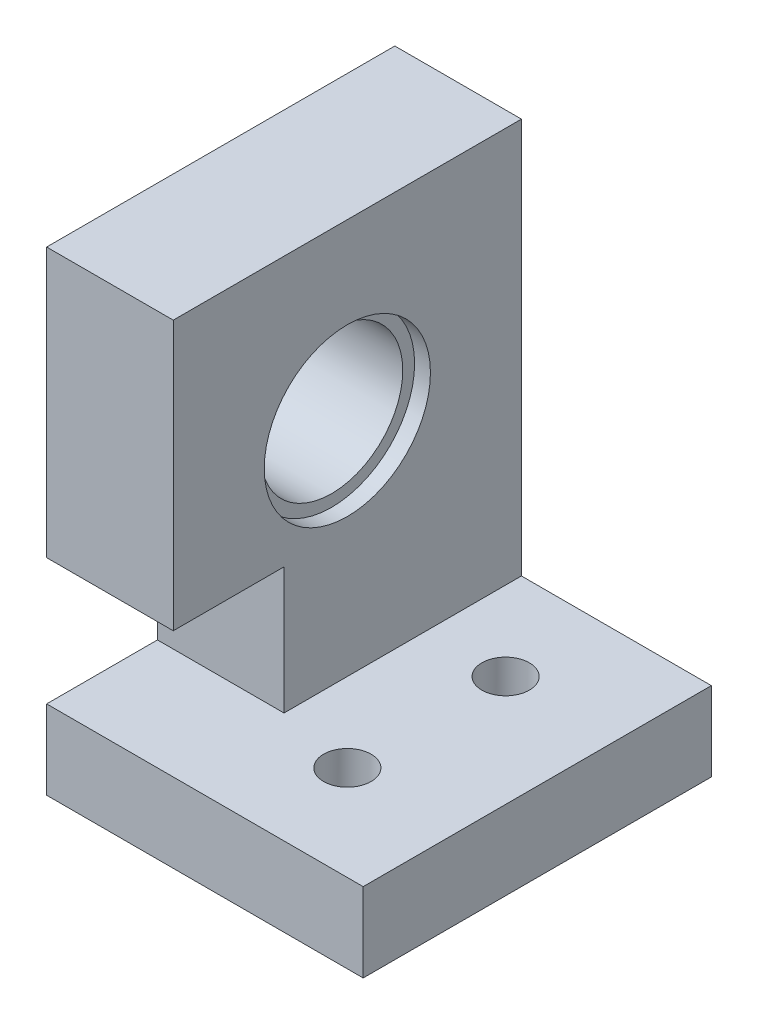
ISO-10303-21;
HEADER;
FILE_DESCRIPTION(('STEP AP214'),'2;1');
FILE_NAME('part.step','',(''),(''),'','','');
FILE_SCHEMA(('AUTOMOTIVE_DESIGN { 1 0 10303 214 1 1 1 1 }'));
ENDSEC;
DATA;
#1=APPLICATION_CONTEXT('core data for automotive mechanical design processes');
#2=APPLICATION_PROTOCOL_DEFINITION('international standard','automotive_design',2000,#1);
#3=PRODUCT_CONTEXT('',#1,'mechanical');
#4=PRODUCT('Part','Part','',(#3));
#5=PRODUCT_RELATED_PRODUCT_CATEGORY('part','',(#4));
#6=PRODUCT_DEFINITION_FORMATION('','',#4);
#7=PRODUCT_DEFINITION_CONTEXT('part definition',#1,'design');
#8=PRODUCT_DEFINITION('design','',#6,#7);
#9=PRODUCT_DEFINITION_SHAPE('','',#8);
#10=(LENGTH_UNIT() NAMED_UNIT(*) SI_UNIT(.MILLI.,.METRE.));
#11=(NAMED_UNIT(*) PLANE_ANGLE_UNIT() SI_UNIT($,.RADIAN.));
#12=(NAMED_UNIT(*) SI_UNIT($,.STERADIAN.) SOLID_ANGLE_UNIT());
#13=UNCERTAINTY_MEASURE_WITH_UNIT(LENGTH_MEASURE(1.E-05),#10,'distance_accuracy_value','');
#14=(GEOMETRIC_REPRESENTATION_CONTEXT(3) GLOBAL_UNCERTAINTY_ASSIGNED_CONTEXT((#13)) GLOBAL_UNIT_ASSIGNED_CONTEXT((#10,
#11,#12)) REPRESENTATION_CONTEXT('',''));
#15=CARTESIAN_POINT('',(0.,0.,0.));
#16=DIRECTION('',(0.,0.,1.));
#17=DIRECTION('',(1.,0.,0.));
#18=AXIS2_PLACEMENT_3D('',#15,#16,#17);
#19=CARTESIAN_POINT('',(8.,-19.,4.));
#20=DIRECTION('',(0.,0.,-1.));
#21=DIRECTION('',(-1.,0.,0.));
#22=AXIS2_PLACEMENT_3D('',#19,#20,#21);
#23=PLANE('',#22);
#24=DIRECTION('',(-1.,0.,0.));
#25=VECTOR('',#24,1.);
#26=CARTESIAN_POINT('',(8.,-14.,4.));
#27=LINE('',#26,#25);
#28=CARTESIAN_POINT('',(8.,-14.,4.));
#29=VERTEX_POINT('',#28);
#30=CARTESIAN_POINT('',(0.,-14.,4.));
#31=VERTEX_POINT('',#30);
#32=EDGE_CURVE('E193',#29,#31,#27,.T.);
#33=ORIENTED_EDGE('',*,*,#32,.F.);
#34=DIRECTION('',(0.,1.,0.));
#35=VECTOR('',#34,1.);
#36=CARTESIAN_POINT('',(8.,-19.,4.));
#37=LINE('',#36,#35);
#38=CARTESIAN_POINT('',(8.,-6.,4.));
#39=VERTEX_POINT('',#38);
#40=EDGE_CURVE('E330',#29,#39,#37,.T.);
#41=ORIENTED_EDGE('',*,*,#40,.T.);
#42=DIRECTION('',(-1.,0.,0.));
#43=VECTOR('',#42,1.);
#44=CARTESIAN_POINT('',(8.,-6.,4.));
#45=LINE('',#44,#43);
#46=CARTESIAN_POINT('',(0.,-6.,4.));
#47=VERTEX_POINT('',#46);
#48=EDGE_CURVE('E320',#39,#47,#45,.T.);
#49=ORIENTED_EDGE('',*,*,#48,.T.);
#50=DIRECTION('',(0.,1.,0.));
#51=VECTOR('',#50,1.);
#52=CARTESIAN_POINT('',(0.,-19.,4.));
#53=LINE('',#52,#51);
#54=EDGE_CURVE('E328',#31,#47,#53,.T.);
#55=ORIENTED_EDGE('',*,*,#54,.F.);
#56=EDGE_LOOP('',(#33,#41,#49,#55));
#57=FACE_BOUND('',#56,.T.);
#58=ADVANCED_FACE('F32',(#57),#23,.F.);
#59=CARTESIAN_POINT('',(13.,-19.,-5.));
#60=DIRECTION('',(0.,1.,0.));
#61=DIRECTION('',(0.,0.,1.));
#62=AXIS2_PLACEMENT_3D('',#59,#60,#61);
#63=CYLINDRICAL_SURFACE('',#62,1.5);
#64=CARTESIAN_POINT('',(13.,-14.,-5.));
#65=DIRECTION('',(0.,1.,0.));
#66=DIRECTION('',(0.,0.,1.));
#67=AXIS2_PLACEMENT_3D('',#64,#65,#66);
#68=CIRCLE('',#67,1.5);
#69=CARTESIAN_POINT('',(13.,-14.,-3.5));
#70=VERTEX_POINT('',#69);
#71=EDGE_CURVE('E310',#70,#70,#68,.T.);
#72=ORIENTED_EDGE('',*,*,#71,.T.);
#73=EDGE_LOOP('',(#72));
#74=FACE_BOUND('',#73,.T.);
#75=CARTESIAN_POINT('',(13.,-16.5,-5.));
#76=DIRECTION('',(0.,-1.,0.));
#77=DIRECTION('',(0.,0.,-1.));
#78=AXIS2_PLACEMENT_3D('',#75,#76,#77);
#79=CIRCLE('',#78,1.5);
#80=CARTESIAN_POINT('',(13.,-16.5,-6.5));
#81=VERTEX_POINT('',#80);
#82=EDGE_CURVE('E36',#81,#81,#79,.F.);
#83=ORIENTED_EDGE('',*,*,#82,.F.);
#84=EDGE_LOOP('',(#83));
#85=FACE_BOUND('',#84,.T.);
#86=ADVANCED_FACE('F374',(#74,#85),#63,.F.);
#87=CARTESIAN_POINT('',(13.,-19.,5.));
#88=DIRECTION('',(0.,1.,0.));
#89=DIRECTION('',(0.,0.,1.));
#90=AXIS2_PLACEMENT_3D('',#87,#88,#89);
#91=CYLINDRICAL_SURFACE('',#90,1.5);
#92=CARTESIAN_POINT('',(13.,-14.,5.));
#93=DIRECTION('',(0.,1.,0.));
#94=DIRECTION('',(0.,0.,1.));
#95=AXIS2_PLACEMENT_3D('',#92,#93,#94);
#96=CIRCLE('',#95,1.5);
#97=CARTESIAN_POINT('',(13.,-14.,6.5));
#98=VERTEX_POINT('',#97);
#99=EDGE_CURVE('E307',#98,#98,#96,.T.);
#100=ORIENTED_EDGE('',*,*,#99,.T.);
#101=EDGE_LOOP('',(#100));
#102=FACE_BOUND('',#101,.T.);
#103=CARTESIAN_POINT('',(13.,-16.5,5.));
#104=DIRECTION('',(0.,-1.,0.));
#105=DIRECTION('',(0.,0.,-1.));
#106=AXIS2_PLACEMENT_3D('',#103,#104,#105);
#107=CIRCLE('',#106,1.5);
#108=CARTESIAN_POINT('',(13.,-16.5,3.5));
#109=VERTEX_POINT('',#108);
#110=EDGE_CURVE('E297',#109,#109,#107,.F.);
#111=ORIENTED_EDGE('',*,*,#110,.F.);
#112=EDGE_LOOP('',(#111));
#113=FACE_BOUND('',#112,.T.);
#114=ADVANCED_FACE('F371',(#102,#113),#91,.F.);
#115=CARTESIAN_POINT('',(8.,-6.,11.));
#116=DIRECTION('',(0.,1.,0.));
#117=DIRECTION('',(0.,0.,1.));
#118=AXIS2_PLACEMENT_3D('',#115,#116,#117);
#119=PLANE('',#118);
#120=DIRECTION('',(0.,0.,-1.));
#121=VECTOR('',#120,1.);
#122=CARTESIAN_POINT('',(8.,-6.,11.));
#123=LINE('',#122,#121);
#124=CARTESIAN_POINT('',(8.,-6.,11.));
#125=VERTEX_POINT('',#124);
#126=EDGE_CURVE('E313',#125,#39,#123,.T.);
#127=ORIENTED_EDGE('',*,*,#126,.F.);
#128=DIRECTION('',(-1.,0.,0.));
#129=VECTOR('',#128,1.);
#130=CARTESIAN_POINT('',(8.,-6.,11.));
#131=LINE('',#130,#129);
#132=CARTESIAN_POINT('',(0.,-6.,11.));
#133=VERTEX_POINT('',#132);
#134=EDGE_CURVE('E11',#125,#133,#131,.T.);
#135=ORIENTED_EDGE('',*,*,#134,.T.);
#136=DIRECTION('',(0.,0.,-1.));
#137=VECTOR('',#136,1.);
#138=CARTESIAN_POINT('',(0.,-6.,11.));
#139=LINE('',#138,#137);
#140=EDGE_CURVE('E364',#133,#47,#139,.T.);
#141=ORIENTED_EDGE('',*,*,#140,.T.);
#142=ORIENTED_EDGE('',*,*,#48,.F.);
#143=EDGE_LOOP('',(#127,#135,#141,#142));
#144=FACE_BOUND('',#143,.T.);
#145=ADVANCED_FACE('F373',(#144),#119,.F.);
#146=CARTESIAN_POINT('',(8.,17.,11.));
#147=DIRECTION('',(0.,0.,-1.));
#148=DIRECTION('',(0.,1.,0.));
#149=AXIS2_PLACEMENT_3D('',#146,#147,#148);
#150=PLANE('',#149);
#151=ORIENTED_EDGE('',*,*,#134,.F.);
#152=DIRECTION('',(0.,-1.,0.));
#153=VECTOR('',#152,1.);
#154=CARTESIAN_POINT('',(8.,17.,11.));
#155=LINE('',#154,#153);
#156=CARTESIAN_POINT('',(8.,11.,11.));
#157=VERTEX_POINT('',#156);
#158=EDGE_CURVE('E41',#157,#125,#155,.T.);
#159=ORIENTED_EDGE('',*,*,#158,.F.);
#160=DIRECTION('',(1.,0.,0.));
#161=VECTOR('',#160,1.);
#162=CARTESIAN_POINT('',(0.,11.,11.));
#163=LINE('',#162,#161);
#164=CARTESIAN_POINT('',(0.,11.,11.));
#165=VERTEX_POINT('',#164);
#166=EDGE_CURVE('E344',#165,#157,#163,.T.);
#167=ORIENTED_EDGE('',*,*,#166,.F.);
#168=DIRECTION('',(0.,-1.,0.));
#169=VECTOR('',#168,1.);
#170=CARTESIAN_POINT('',(0.,17.,11.));
#171=LINE('',#170,#169);
#172=EDGE_CURVE('E360',#165,#133,#171,.T.);
#173=ORIENTED_EDGE('',*,*,#172,.T.);
#174=EDGE_LOOP('',(#151,#159,#167,#173));
#175=FACE_BOUND('',#174,.T.);
#176=ADVANCED_FACE('F34',(#175),#150,.F.);
#177=CARTESIAN_POINT('',(0.,11.,-11.));
#178=DIRECTION('',(0.,0.,1.));
#179=DIRECTION('',(0.,-1.,0.));
#180=AXIS2_PLACEMENT_3D('',#177,#178,#179);
#181=PLANE('',#180);
#182=DIRECTION('',(1.,0.,0.));
#183=VECTOR('',#182,1.);
#184=CARTESIAN_POINT('',(0.,11.,-11.));
#185=LINE('',#184,#183);
#186=CARTESIAN_POINT('',(0.,11.,-11.));
#187=VERTEX_POINT('',#186);
#188=CARTESIAN_POINT('',(8.,11.,-11.));
#189=VERTEX_POINT('',#188);
#190=EDGE_CURVE('E347',#187,#189,#185,.T.);
#191=ORIENTED_EDGE('',*,*,#190,.T.);
#192=DIRECTION('',(0.,1.,0.));
#193=VECTOR('',#192,1.);
#194=CARTESIAN_POINT('',(8.,-19.,-11.));
#195=LINE('',#194,#193);
#196=CARTESIAN_POINT('',(8.,-14.,-11.));
#197=VERTEX_POINT('',#196);
#198=EDGE_CURVE('E324',#197,#189,#195,.T.);
#199=ORIENTED_EDGE('',*,*,#198,.F.);
#200=DIRECTION('',(-1.,0.,0.));
#201=VECTOR('',#200,1.);
#202=CARTESIAN_POINT('',(18.,-14.,-11.));
#203=LINE('',#202,#201);
#204=CARTESIAN_POINT('',(20.,-14.,-11.));
#205=VERTEX_POINT('',#204);
#206=EDGE_CURVE('E186',#205,#197,#203,.T.);
#207=ORIENTED_EDGE('',*,*,#206,.F.);
#208=DIRECTION('',(0.,1.,0.));
#209=VECTOR('',#208,1.);
#210=CARTESIAN_POINT('',(20.,-19.,-11.));
#211=LINE('',#210,#209);
#212=CARTESIAN_POINT('',(20.,-19.,-11.));
#213=VERTEX_POINT('',#212);
#214=EDGE_CURVE('E209',#213,#205,#211,.T.);
#215=ORIENTED_EDGE('',*,*,#214,.F.);
#216=DIRECTION('',(1.,0.,0.));
#217=VECTOR('',#216,1.);
#218=CARTESIAN_POINT('',(8.,-19.,-11.));
#219=LINE('',#218,#217);
#220=CARTESIAN_POINT('',(0.,-19.,-11.));
#221=VERTEX_POINT('',#220);
#222=EDGE_CURVE('E322',#221,#213,#219,.T.);
#223=ORIENTED_EDGE('',*,*,#222,.F.);
#224=DIRECTION('',(0.,-1.,0.));
#225=VECTOR('',#224,1.);
#226=CARTESIAN_POINT('',(0.,11.,-11.));
#227=LINE('',#226,#225);
#228=EDGE_CURVE('E341',#187,#221,#227,.T.);
#229=ORIENTED_EDGE('',*,*,#228,.F.);
#230=EDGE_LOOP('',(#191,#199,#207,#215,#223,#229));
#231=FACE_BOUND('',#230,.T.);
#232=ADVANCED_FACE('F403',(#231),#181,.F.);
#233=CARTESIAN_POINT('',(8.,-6.,11.));
#234=DIRECTION('',(1.,0.,0.));
#235=DIRECTION('',(0.,0.,-1.));
#236=AXIS2_PLACEMENT_3D('',#233,#234,#235);
#237=PLANE('',#236);
#238=ORIENTED_EDGE('',*,*,#126,.T.);
#239=ORIENTED_EDGE('',*,*,#40,.F.);
#240=DIRECTION('',(0.,0.,1.));
#241=VECTOR('',#240,1.);
#242=CARTESIAN_POINT('',(8.,-14.,-11.));
#243=LINE('',#242,#241);
#244=EDGE_CURVE('E316',#197,#29,#243,.T.);
#245=ORIENTED_EDGE('',*,*,#244,.F.);
#246=ORIENTED_EDGE('',*,*,#198,.T.);
#247=DIRECTION('',(0.,0.,-1.));
#248=VECTOR('',#247,1.);
#249=CARTESIAN_POINT('',(8.,11.,11.));
#250=LINE('',#249,#248);
#251=EDGE_CURVE('E342',#157,#189,#250,.T.);
#252=ORIENTED_EDGE('',*,*,#251,.F.);
#253=ORIENTED_EDGE('',*,*,#158,.T.);
#254=EDGE_LOOP('',(#238,#239,#245,#246,#252,#253));
#255=FACE_BOUND('',#254,.T.);
#256=CARTESIAN_POINT('',(8.,0.,0.));
#257=DIRECTION('',(1.,0.,0.));
#258=DIRECTION('',(0.,0.,-1.));
#259=AXIS2_PLACEMENT_3D('',#256,#257,#258);
#260=CIRCLE('',#259,5.25);
#261=CARTESIAN_POINT('',(8.,0.,-5.25));
#262=VERTEX_POINT('',#261);
#263=EDGE_CURVE('E332',#262,#262,#260,.T.);
#264=ORIENTED_EDGE('',*,*,#263,.F.);
#265=EDGE_LOOP('',(#264));
#266=FACE_BOUND('',#265,.T.);
#267=ADVANCED_FACE('F406',(#255,#266),#237,.T.);
#268=CARTESIAN_POINT('',(8.,0.,0.));
#269=DIRECTION('',(-1.,0.,0.));
#270=DIRECTION('',(0.,0.,1.));
#271=AXIS2_PLACEMENT_3D('',#268,#269,#270);
#272=CYLINDRICAL_SURFACE('',#271,4.5);
#273=CARTESIAN_POINT('',(1.,0.,0.));
#274=DIRECTION('',(-1.,0.,0.));
#275=DIRECTION('',(0.,0.,1.));
#276=AXIS2_PLACEMENT_3D('',#273,#274,#275);
#277=CIRCLE('',#276,4.5);
#278=CARTESIAN_POINT('',(1.,0.,4.5));
#279=VERTEX_POINT('',#278);
#280=EDGE_CURVE('E355',#279,#279,#277,.T.);
#281=ORIENTED_EDGE('',*,*,#280,.T.);
#282=EDGE_LOOP('',(#281));
#283=FACE_BOUND('',#282,.T.);
#284=CARTESIAN_POINT('',(7.,0.,0.));
#285=DIRECTION('',(1.,0.,0.));
#286=DIRECTION('',(0.,0.,-1.));
#287=AXIS2_PLACEMENT_3D('',#284,#285,#286);
#288=CIRCLE('',#287,4.5);
#289=CARTESIAN_POINT('',(7.,0.,-4.5));
#290=VERTEX_POINT('',#289);
#291=EDGE_CURVE('E336',#290,#290,#288,.T.);
#292=ORIENTED_EDGE('',*,*,#291,.T.);
#293=EDGE_LOOP('',(#292));
#294=FACE_BOUND('',#293,.T.);
#295=ADVANCED_FACE('F419',(#283,#294),#272,.F.);
#296=CARTESIAN_POINT('',(0.,-6.,11.));
#297=DIRECTION('',(1.,0.,0.));
#298=DIRECTION('',(0.,0.,-1.));
#299=AXIS2_PLACEMENT_3D('',#296,#297,#298);
#300=PLANE('',#299);
#301=CARTESIAN_POINT('',(0.,0.,0.));
#302=DIRECTION('',(-1.,0.,0.));
#303=DIRECTION('',(0.,0.,1.));
#304=AXIS2_PLACEMENT_3D('',#301,#302,#303);
#305=CIRCLE('',#304,5.25);
#306=CARTESIAN_POINT('',(0.,0.,5.25));
#307=VERTEX_POINT('',#306);
#308=EDGE_CURVE('E350',#307,#307,#305,.T.);
#309=ORIENTED_EDGE('',*,*,#308,.F.);
#310=EDGE_LOOP('',(#309));
#311=FACE_BOUND('',#310,.T.);
#312=DIRECTION('',(0.,0.,-1.));
#313=VECTOR('',#312,1.);
#314=CARTESIAN_POINT('',(0.,11.,11.));
#315=LINE('',#314,#313);
#316=EDGE_CURVE('E339',#165,#187,#315,.T.);
#317=ORIENTED_EDGE('',*,*,#316,.T.);
#318=ORIENTED_EDGE('',*,*,#228,.T.);
#319=DIRECTION('',(0.,0.,-1.));
#320=VECTOR('',#319,1.);
#321=CARTESIAN_POINT('',(0.,-19.,-11.));
#322=LINE('',#321,#320);
#323=CARTESIAN_POINT('',(0.,-19.,11.));
#324=VERTEX_POINT('',#323);
#325=EDGE_CURVE('E200',#324,#221,#322,.T.);
#326=ORIENTED_EDGE('',*,*,#325,.F.);
#327=DIRECTION('',(0.,-1.,0.));
#328=VECTOR('',#327,1.);
#329=CARTESIAN_POINT('',(0.,-19.,11.));
#330=LINE('',#329,#328);
#331=CARTESIAN_POINT('',(0.,-14.,11.));
#332=VERTEX_POINT('',#331);
#333=EDGE_CURVE('E180',#332,#324,#330,.T.);
#334=ORIENTED_EDGE('',*,*,#333,.F.);
#335=DIRECTION('',(0.,0.,-1.));
#336=VECTOR('',#335,1.);
#337=CARTESIAN_POINT('',(0.,-14.,11.));
#338=LINE('',#337,#336);
#339=EDGE_CURVE('E190',#332,#31,#338,.T.);
#340=ORIENTED_EDGE('',*,*,#339,.T.);
#341=ORIENTED_EDGE('',*,*,#54,.T.);
#342=ORIENTED_EDGE('',*,*,#140,.F.);
#343=ORIENTED_EDGE('',*,*,#172,.F.);
#344=EDGE_LOOP('',(#317,#318,#326,#334,#340,#341,#342,#343));
#345=FACE_BOUND('',#344,.T.);
#346=ADVANCED_FACE('F198',(#311,#345),#300,.F.);
#347=CARTESIAN_POINT('',(1.,0.,0.));
#348=DIRECTION('',(-1.,0.,0.));
#349=DIRECTION('',(0.,0.,1.));
#350=AXIS2_PLACEMENT_3D('',#347,#348,#349);
#351=CYLINDRICAL_SURFACE('',#350,5.25);
#352=CARTESIAN_POINT('',(1.,0.,0.));
#353=DIRECTION('',(-1.,0.,0.));
#354=DIRECTION('',(0.,0.,1.));
#355=AXIS2_PLACEMENT_3D('',#352,#353,#354);
#356=CIRCLE('',#355,5.25);
#357=CARTESIAN_POINT('',(1.,0.,5.25));
#358=VERTEX_POINT('',#357);
#359=EDGE_CURVE('E352',#358,#358,#356,.T.);
#360=ORIENTED_EDGE('',*,*,#359,.F.);
#361=EDGE_LOOP('',(#360));
#362=FACE_BOUND('',#361,.T.);
#363=ORIENTED_EDGE('',*,*,#308,.T.);
#364=EDGE_LOOP('',(#363));
#365=FACE_BOUND('',#364,.T.);
#366=ADVANCED_FACE('F414',(#362,#365),#351,.F.);
#367=CARTESIAN_POINT('',(1.,0.,0.));
#368=DIRECTION('',(-1.,0.,0.));
#369=DIRECTION('',(0.,0.,1.));
#370=AXIS2_PLACEMENT_3D('',#367,#368,#369);
#371=PLANE('',#370);
#372=ORIENTED_EDGE('',*,*,#280,.F.);
#373=EDGE_LOOP('',(#372));
#374=FACE_BOUND('',#373,.T.);
#375=ORIENTED_EDGE('',*,*,#359,.T.);
#376=EDGE_LOOP('',(#375));
#377=FACE_BOUND('',#376,.T.);
#378=ADVANCED_FACE('F410',(#374,#377),#371,.T.);
#379=CARTESIAN_POINT('',(0.,11.,11.));
#380=DIRECTION('',(0.,-1.,0.));
#381=DIRECTION('',(0.,0.,-1.));
#382=AXIS2_PLACEMENT_3D('',#379,#380,#381);
#383=PLANE('',#382);
#384=ORIENTED_EDGE('',*,*,#251,.T.);
#385=ORIENTED_EDGE('',*,*,#190,.F.);
#386=ORIENTED_EDGE('',*,*,#316,.F.);
#387=ORIENTED_EDGE('',*,*,#166,.T.);
#388=EDGE_LOOP('',(#384,#385,#386,#387));
#389=FACE_BOUND('',#388,.T.);
#390=ADVANCED_FACE('F401',(#389),#383,.F.);
#391=CARTESIAN_POINT('',(7.,0.,0.));
#392=DIRECTION('',(1.,0.,0.));
#393=DIRECTION('',(0.,0.,-1.));
#394=AXIS2_PLACEMENT_3D('',#391,#392,#393);
#395=CYLINDRICAL_SURFACE('',#394,5.25);
#396=CARTESIAN_POINT('',(7.,0.,0.));
#397=DIRECTION('',(1.,0.,0.));
#398=DIRECTION('',(0.,0.,-1.));
#399=AXIS2_PLACEMENT_3D('',#396,#397,#398);
#400=CIRCLE('',#399,5.25);
#401=CARTESIAN_POINT('',(7.,0.,-5.25));
#402=VERTEX_POINT('',#401);
#403=EDGE_CURVE('E333',#402,#402,#400,.T.);
#404=ORIENTED_EDGE('',*,*,#403,.F.);
#405=EDGE_LOOP('',(#404));
#406=FACE_BOUND('',#405,.T.);
#407=ORIENTED_EDGE('',*,*,#263,.T.);
#408=EDGE_LOOP('',(#407));
#409=FACE_BOUND('',#408,.T.);
#410=ADVANCED_FACE('F397',(#406,#409),#395,.F.);
#411=CARTESIAN_POINT('',(7.,0.,0.));
#412=DIRECTION('',(1.,0.,0.));
#413=DIRECTION('',(0.,0.,-1.));
#414=AXIS2_PLACEMENT_3D('',#411,#412,#413);
#415=PLANE('',#414);
#416=ORIENTED_EDGE('',*,*,#291,.F.);
#417=EDGE_LOOP('',(#416));
#418=FACE_BOUND('',#417,.T.);
#419=ORIENTED_EDGE('',*,*,#403,.T.);
#420=EDGE_LOOP('',(#419));
#421=FACE_BOUND('',#420,.T.);
#422=ADVANCED_FACE('F394',(#418,#421),#415,.T.);
#423=CARTESIAN_POINT('',(8.,-19.,4.));
#424=DIRECTION('',(0.,-1.,0.));
#425=DIRECTION('',(0.,0.,-1.));
#426=AXIS2_PLACEMENT_3D('',#423,#424,#425);
#427=PLANE('',#426);
#428=DIRECTION('',(-1.,0.,0.));
#429=VECTOR('',#428,1.);
#430=CARTESIAN_POINT('',(18.,-19.,11.));
#431=LINE('',#430,#429);
#432=CARTESIAN_POINT('',(20.,-19.,11.));
#433=VERTEX_POINT('',#432);
#434=EDGE_CURVE('E187',#433,#324,#431,.T.);
#435=ORIENTED_EDGE('',*,*,#434,.T.);
#436=ORIENTED_EDGE('',*,*,#325,.T.);
#437=ORIENTED_EDGE('',*,*,#222,.T.);
#438=DIRECTION('',(0.,0.,-1.));
#439=VECTOR('',#438,1.);
#440=CARTESIAN_POINT('',(20.,-19.,11.));
#441=LINE('',#440,#439);
#442=EDGE_CURVE('E206',#433,#213,#441,.T.);
#443=ORIENTED_EDGE('',*,*,#442,.F.);
#444=EDGE_LOOP('',(#435,#436,#437,#443));
#445=FACE_BOUND('',#444,.T.);
#446=DIRECTION('',(0.5,0.,0.866025403784439));
#447=VECTOR('',#446,1.);
#448=CARTESIAN_POINT('',(14.6021469970012,-19.,-7.775));
#449=LINE('',#448,#447);
#450=CARTESIAN_POINT('',(14.6021469970012,-19.,-7.775));
#451=VERTEX_POINT('',#450);
#452=CARTESIAN_POINT('',(16.2042939940024,-19.,-5.));
#453=VERTEX_POINT('',#452);
#454=EDGE_CURVE('E49',#451,#453,#449,.T.);
#455=ORIENTED_EDGE('',*,*,#454,.F.);
#456=DIRECTION('',(1.,0.,0.));
#457=VECTOR('',#456,1.);
#458=CARTESIAN_POINT('',(11.3978530029988,-19.,-7.775));
#459=LINE('',#458,#457);
#460=CARTESIAN_POINT('',(11.3978530029988,-19.,-7.775));
#461=VERTEX_POINT('',#460);
#462=EDGE_CURVE('E218',#461,#451,#459,.T.);
#463=ORIENTED_EDGE('',*,*,#462,.F.);
#464=DIRECTION('',(0.5,0.,-0.866025403784439));
#465=VECTOR('',#464,1.);
#466=CARTESIAN_POINT('',(9.79570600599758,-19.,-5.));
#467=LINE('',#466,#465);
#468=CARTESIAN_POINT('',(9.79570600599758,-19.,-5.));
#469=VERTEX_POINT('',#468);
#470=EDGE_CURVE('E244',#469,#461,#467,.T.);
#471=ORIENTED_EDGE('',*,*,#470,.F.);
#472=DIRECTION('',(-0.5,0.,-0.866025403784438));
#473=VECTOR('',#472,1.);
#474=CARTESIAN_POINT('',(11.3978530029988,-19.,-2.225));
#475=LINE('',#474,#473);
#476=CARTESIAN_POINT('',(11.3978530029988,-19.,-2.225));
#477=VERTEX_POINT('',#476);
#478=EDGE_CURVE('E241',#477,#469,#475,.T.);
#479=ORIENTED_EDGE('',*,*,#478,.F.);
#480=DIRECTION('',(-1.,0.,0.));
#481=VECTOR('',#480,1.);
#482=CARTESIAN_POINT('',(14.6021469970012,-19.,-2.225));
#483=LINE('',#482,#481);
#484=CARTESIAN_POINT('',(14.6021469970012,-19.,-2.225));
#485=VERTEX_POINT('',#484);
#486=EDGE_CURVE('E238',#485,#477,#483,.T.);
#487=ORIENTED_EDGE('',*,*,#486,.F.);
#488=DIRECTION('',(-0.5,0.,0.866025403784438));
#489=VECTOR('',#488,1.);
#490=CARTESIAN_POINT('',(16.2042939940024,-19.,-5.));
#491=LINE('',#490,#489);
#492=EDGE_CURVE('E235',#453,#485,#491,.T.);
#493=ORIENTED_EDGE('',*,*,#492,.F.);
#494=EDGE_LOOP('',(#455,#463,#471,#479,#487,#493));
#495=FACE_BOUND('',#494,.T.);
#496=DIRECTION('',(0.5,0.,0.866025403784439));
#497=VECTOR('',#496,1.);
#498=CARTESIAN_POINT('',(14.6021469970012,-19.,2.22499999999999));
#499=LINE('',#498,#497);
#500=CARTESIAN_POINT('',(14.6021469970012,-19.,2.22499999999999));
#501=VERTEX_POINT('',#500);
#502=CARTESIAN_POINT('',(16.2042939940024,-19.,5.));
#503=VERTEX_POINT('',#502);
#504=EDGE_CURVE('E57',#501,#503,#499,.T.);
#505=ORIENTED_EDGE('',*,*,#504,.F.);
#506=DIRECTION('',(1.,0.,0.));
#507=VECTOR('',#506,1.);
#508=CARTESIAN_POINT('',(11.3978530029988,-19.,2.22499999999999));
#509=LINE('',#508,#507);
#510=CARTESIAN_POINT('',(11.3978530029988,-19.,2.22499999999999));
#511=VERTEX_POINT('',#510);
#512=EDGE_CURVE('E264',#511,#501,#509,.T.);
#513=ORIENTED_EDGE('',*,*,#512,.F.);
#514=DIRECTION('',(0.5,0.,-0.866025403784439));
#515=VECTOR('',#514,1.);
#516=CARTESIAN_POINT('',(9.79570600599758,-19.,4.99999999999999));
#517=LINE('',#516,#515);
#518=CARTESIAN_POINT('',(9.79570600599758,-19.,4.99999999999999));
#519=VERTEX_POINT('',#518);
#520=EDGE_CURVE('E290',#519,#511,#517,.T.);
#521=ORIENTED_EDGE('',*,*,#520,.F.);
#522=DIRECTION('',(-0.5,0.,-0.866025403784439));
#523=VECTOR('',#522,1.);
#524=CARTESIAN_POINT('',(11.3978530029988,-19.,7.77499999999999));
#525=LINE('',#524,#523);
#526=CARTESIAN_POINT('',(11.3978530029988,-19.,7.77499999999999));
#527=VERTEX_POINT('',#526);
#528=EDGE_CURVE('E287',#527,#519,#525,.T.);
#529=ORIENTED_EDGE('',*,*,#528,.F.);
#530=DIRECTION('',(-1.,0.,0.));
#531=VECTOR('',#530,1.);
#532=CARTESIAN_POINT('',(14.6021469970012,-19.,7.77499999999999));
#533=LINE('',#532,#531);
#534=CARTESIAN_POINT('',(14.6021469970012,-19.,7.77499999999999));
#535=VERTEX_POINT('',#534);
#536=EDGE_CURVE('E284',#535,#527,#533,.T.);
#537=ORIENTED_EDGE('',*,*,#536,.F.);
#538=DIRECTION('',(-0.499999999999999,0.,0.866025403784439));
#539=VECTOR('',#538,1.);
#540=CARTESIAN_POINT('',(16.2042939940024,-19.,5.));
#541=LINE('',#540,#539);
#542=EDGE_CURVE('E281',#503,#535,#541,.T.);
#543=ORIENTED_EDGE('',*,*,#542,.F.);
#544=EDGE_LOOP('',(#505,#513,#521,#529,#537,#543));
#545=FACE_BOUND('',#544,.T.);
#546=ADVANCED_FACE('F392',(#445,#495,#545),#427,.T.);
#547=CARTESIAN_POINT('',(18.,-14.,-11.));
#548=DIRECTION('',(0.,-1.,0.));
#549=DIRECTION('',(0.,0.,-1.));
#550=AXIS2_PLACEMENT_3D('',#547,#548,#549);
#551=PLANE('',#550);
#552=ORIENTED_EDGE('',*,*,#99,.F.);
#553=EDGE_LOOP('',(#552));
#554=FACE_BOUND('',#553,.T.);
#555=ORIENTED_EDGE('',*,*,#71,.F.);
#556=EDGE_LOOP('',(#555));
#557=FACE_BOUND('',#556,.T.);
#558=ORIENTED_EDGE('',*,*,#244,.T.);
#559=ORIENTED_EDGE('',*,*,#32,.T.);
#560=ORIENTED_EDGE('',*,*,#339,.F.);
#561=DIRECTION('',(-1.,0.,0.));
#562=VECTOR('',#561,1.);
#563=CARTESIAN_POINT('',(18.,-14.,11.));
#564=LINE('',#563,#562);
#565=CARTESIAN_POINT('',(20.,-14.,11.));
#566=VERTEX_POINT('',#565);
#567=EDGE_CURVE('E176',#566,#332,#564,.T.);
#568=ORIENTED_EDGE('',*,*,#567,.F.);
#569=DIRECTION('',(0.,0.,1.));
#570=VECTOR('',#569,1.);
#571=CARTESIAN_POINT('',(20.,-14.,11.));
#572=LINE('',#571,#570);
#573=EDGE_CURVE('E212',#205,#566,#572,.T.);
#574=ORIENTED_EDGE('',*,*,#573,.F.);
#575=ORIENTED_EDGE('',*,*,#206,.T.);
#576=EDGE_LOOP('',(#558,#559,#560,#568,#574,#575));
#577=FACE_BOUND('',#576,.T.);
#578=ADVANCED_FACE('F192',(#554,#557,#577),#551,.F.);
#579=CARTESIAN_POINT('',(18.,-19.,11.));
#580=DIRECTION('',(0.,0.,-1.));
#581=DIRECTION('',(-1.,0.,0.));
#582=AXIS2_PLACEMENT_3D('',#579,#580,#581);
#583=PLANE('',#582);
#584=ORIENTED_EDGE('',*,*,#567,.T.);
#585=ORIENTED_EDGE('',*,*,#333,.T.);
#586=ORIENTED_EDGE('',*,*,#434,.F.);
#587=DIRECTION('',(0.,-1.,0.));
#588=VECTOR('',#587,1.);
#589=CARTESIAN_POINT('',(20.,-19.,11.));
#590=LINE('',#589,#588);
#591=EDGE_CURVE('E182',#566,#433,#590,.T.);
#592=ORIENTED_EDGE('',*,*,#591,.F.);
#593=EDGE_LOOP('',(#584,#585,#586,#592));
#594=FACE_BOUND('',#593,.T.);
#595=ADVANCED_FACE('F178',(#594),#583,.F.);
#596=CARTESIAN_POINT('',(16.2042939940024,-16.5,5.));
#597=DIRECTION('',(0.,-1.,0.));
#598=DIRECTION('',(0.,0.,-1.));
#599=AXIS2_PLACEMENT_3D('',#596,#597,#598);
#600=PLANE('',#599);
#601=DIRECTION('',(0.5,0.,0.866025403784439));
#602=VECTOR('',#601,1.);
#603=CARTESIAN_POINT('',(14.6021469970012,-16.5,2.22499999999999));
#604=LINE('',#603,#602);
#605=CARTESIAN_POINT('',(14.6021469970012,-16.5,2.22499999999999));
#606=VERTEX_POINT('',#605);
#607=CARTESIAN_POINT('',(16.2042939940024,-16.5,5.));
#608=VERTEX_POINT('',#607);
#609=EDGE_CURVE('E260',#606,#608,#604,.T.);
#610=ORIENTED_EDGE('',*,*,#609,.T.);
#611=DIRECTION('',(-0.499999999999999,0.,0.866025403784439));
#612=VECTOR('',#611,1.);
#613=CARTESIAN_POINT('',(16.2042939940024,-16.5,5.));
#614=LINE('',#613,#612);
#615=CARTESIAN_POINT('',(14.6021469970012,-16.5,7.77499999999999));
#616=VERTEX_POINT('',#615);
#617=EDGE_CURVE('E263',#608,#616,#614,.T.);
#618=ORIENTED_EDGE('',*,*,#617,.T.);
#619=DIRECTION('',(-1.,0.,0.));
#620=VECTOR('',#619,1.);
#621=CARTESIAN_POINT('',(14.6021469970012,-16.5,7.77499999999999));
#622=LINE('',#621,#620);
#623=CARTESIAN_POINT('',(11.3978530029988,-16.5,7.77499999999999));
#624=VERTEX_POINT('',#623);
#625=EDGE_CURVE('E267',#616,#624,#622,.T.);
#626=ORIENTED_EDGE('',*,*,#625,.T.);
#627=DIRECTION('',(-0.5,0.,-0.866025403784439));
#628=VECTOR('',#627,1.);
#629=CARTESIAN_POINT('',(11.3978530029988,-16.5,7.77499999999999));
#630=LINE('',#629,#628);
#631=CARTESIAN_POINT('',(9.79570600599758,-16.5,4.99999999999999));
#632=VERTEX_POINT('',#631);
#633=EDGE_CURVE('E270',#624,#632,#630,.T.);
#634=ORIENTED_EDGE('',*,*,#633,.T.);
#635=DIRECTION('',(0.5,0.,-0.866025403784439));
#636=VECTOR('',#635,1.);
#637=CARTESIAN_POINT('',(9.79570600599758,-16.5,4.99999999999999));
#638=LINE('',#637,#636);
#639=CARTESIAN_POINT('',(11.3978530029988,-16.5,2.22499999999999));
#640=VERTEX_POINT('',#639);
#641=EDGE_CURVE('E273',#632,#640,#638,.T.);
#642=ORIENTED_EDGE('',*,*,#641,.T.);
#643=DIRECTION('',(1.,0.,0.));
#644=VECTOR('',#643,1.);
#645=CARTESIAN_POINT('',(11.3978530029988,-16.5,2.22499999999999));
#646=LINE('',#645,#644);
#647=EDGE_CURVE('E276',#640,#606,#646,.T.);
#648=ORIENTED_EDGE('',*,*,#647,.T.);
#649=EDGE_LOOP('',(#610,#618,#626,#634,#642,#648));
#650=FACE_BOUND('',#649,.T.);
#651=ORIENTED_EDGE('',*,*,#110,.T.);
#652=EDGE_LOOP('',(#651));
#653=FACE_BOUND('',#652,.T.);
#654=ADVANCED_FACE('F369',(#650,#653),#600,.T.);
#655=CARTESIAN_POINT('',(14.6021469970012,-16.5,2.22499999999999));
#656=DIRECTION('',(0.866025403784439,0.,-0.5));
#657=DIRECTION('',(-0.5,0.,-0.866025403784439));
#658=AXIS2_PLACEMENT_3D('',#655,#656,#657);
#659=PLANE('',#658);
#660=ORIENTED_EDGE('',*,*,#504,.T.);
#661=DIRECTION('',(0.,-1.,0.));
#662=VECTOR('',#661,1.);
#663=CARTESIAN_POINT('',(16.2042939940024,-16.5,5.));
#664=LINE('',#663,#662);
#665=EDGE_CURVE('E279',#608,#503,#664,.T.);
#666=ORIENTED_EDGE('',*,*,#665,.F.);
#667=ORIENTED_EDGE('',*,*,#609,.F.);
#668=DIRECTION('',(0.,-1.,0.));
#669=VECTOR('',#668,1.);
#670=CARTESIAN_POINT('',(14.6021469970012,-16.5,2.22499999999999));
#671=LINE('',#670,#669);
#672=EDGE_CURVE('E295',#606,#501,#671,.T.);
#673=ORIENTED_EDGE('',*,*,#672,.T.);
#674=EDGE_LOOP('',(#660,#666,#667,#673));
#675=FACE_BOUND('',#674,.T.);
#676=ADVANCED_FACE('F482',(#675),#659,.F.);
#677=CARTESIAN_POINT('',(11.3978530029988,-16.5,2.22499999999999));
#678=DIRECTION('',(0.,0.,-1.));
#679=DIRECTION('',(-1.,0.,0.));
#680=AXIS2_PLACEMENT_3D('',#677,#678,#679);
#681=PLANE('',#680);
#682=ORIENTED_EDGE('',*,*,#512,.T.);
#683=ORIENTED_EDGE('',*,*,#672,.F.);
#684=ORIENTED_EDGE('',*,*,#647,.F.);
#685=DIRECTION('',(0.,-1.,0.));
#686=VECTOR('',#685,1.);
#687=CARTESIAN_POINT('',(11.3978530029988,-16.5,2.22499999999999));
#688=LINE('',#687,#686);
#689=EDGE_CURVE('E298',#640,#511,#688,.T.);
#690=ORIENTED_EDGE('',*,*,#689,.T.);
#691=EDGE_LOOP('',(#682,#683,#684,#690));
#692=FACE_BOUND('',#691,.T.);
#693=ADVANCED_FACE('F490',(#692),#681,.F.);
#694=CARTESIAN_POINT('',(9.79570600599758,-16.5,4.99999999999999));
#695=DIRECTION('',(-0.866025403784439,0.,-0.5));
#696=DIRECTION('',(-0.5,0.,0.866025403784439));
#697=AXIS2_PLACEMENT_3D('',#694,#695,#696);
#698=PLANE('',#697);
#699=ORIENTED_EDGE('',*,*,#520,.T.);
#700=ORIENTED_EDGE('',*,*,#689,.F.);
#701=ORIENTED_EDGE('',*,*,#641,.F.);
#702=DIRECTION('',(0.,-1.,0.));
#703=VECTOR('',#702,1.);
#704=CARTESIAN_POINT('',(9.79570600599758,-16.5,4.99999999999999));
#705=LINE('',#704,#703);
#706=EDGE_CURVE('E300',#632,#519,#705,.T.);
#707=ORIENTED_EDGE('',*,*,#706,.T.);
#708=EDGE_LOOP('',(#699,#700,#701,#707));
#709=FACE_BOUND('',#708,.T.);
#710=ADVANCED_FACE('F496',(#709),#698,.F.);
#711=CARTESIAN_POINT('',(11.3978530029988,-16.5,7.77499999999999));
#712=DIRECTION('',(-0.866025403784439,0.,0.5));
#713=DIRECTION('',(0.5,0.,0.866025403784439));
#714=AXIS2_PLACEMENT_3D('',#711,#712,#713);
#715=PLANE('',#714);
#716=ORIENTED_EDGE('',*,*,#528,.T.);
#717=ORIENTED_EDGE('',*,*,#706,.F.);
#718=ORIENTED_EDGE('',*,*,#633,.F.);
#719=DIRECTION('',(0.,-1.,0.));
#720=VECTOR('',#719,1.);
#721=CARTESIAN_POINT('',(11.3978530029988,-16.5,7.77499999999999));
#722=LINE('',#721,#720);
#723=EDGE_CURVE('E302',#624,#527,#722,.T.);
#724=ORIENTED_EDGE('',*,*,#723,.T.);
#725=EDGE_LOOP('',(#716,#717,#718,#724));
#726=FACE_BOUND('',#725,.T.);
#727=ADVANCED_FACE('F504',(#726),#715,.F.);
#728=CARTESIAN_POINT('',(14.6021469970012,-16.5,7.77499999999999));
#729=DIRECTION('',(0.,0.,1.));
#730=DIRECTION('',(1.,0.,0.));
#731=AXIS2_PLACEMENT_3D('',#728,#729,#730);
#732=PLANE('',#731);
#733=ORIENTED_EDGE('',*,*,#536,.T.);
#734=ORIENTED_EDGE('',*,*,#723,.F.);
#735=ORIENTED_EDGE('',*,*,#625,.F.);
#736=DIRECTION('',(0.,-1.,0.));
#737=VECTOR('',#736,1.);
#738=CARTESIAN_POINT('',(14.6021469970012,-16.5,7.77499999999999));
#739=LINE('',#738,#737);
#740=EDGE_CURVE('E304',#616,#535,#739,.T.);
#741=ORIENTED_EDGE('',*,*,#740,.T.);
#742=EDGE_LOOP('',(#733,#734,#735,#741));
#743=FACE_BOUND('',#742,.T.);
#744=ADVANCED_FACE('F512',(#743),#732,.F.);
#745=CARTESIAN_POINT('',(16.2042939940024,-16.5,5.));
#746=DIRECTION('',(0.866025403784439,0.,0.499999999999999));
#747=DIRECTION('',(0.499999999999999,0.,-0.866025403784439));
#748=AXIS2_PLACEMENT_3D('',#745,#746,#747);
#749=PLANE('',#748);
#750=ORIENTED_EDGE('',*,*,#542,.T.);
#751=ORIENTED_EDGE('',*,*,#740,.F.);
#752=ORIENTED_EDGE('',*,*,#617,.F.);
#753=ORIENTED_EDGE('',*,*,#665,.T.);
#754=EDGE_LOOP('',(#750,#751,#752,#753));
#755=FACE_BOUND('',#754,.T.);
#756=ADVANCED_FACE('F520',(#755),#749,.F.);
#757=CARTESIAN_POINT('',(16.2042939940024,-16.5,-5.));
#758=DIRECTION('',(0.,-1.,0.));
#759=DIRECTION('',(0.,0.,-1.));
#760=AXIS2_PLACEMENT_3D('',#757,#758,#759);
#761=PLANE('',#760);
#762=DIRECTION('',(0.5,0.,0.866025403784439));
#763=VECTOR('',#762,1.);
#764=CARTESIAN_POINT('',(14.6021469970012,-16.5,-7.775));
#765=LINE('',#764,#763);
#766=CARTESIAN_POINT('',(14.6021469970012,-16.5,-7.775));
#767=VERTEX_POINT('',#766);
#768=CARTESIAN_POINT('',(16.2042939940024,-16.5,-5.));
#769=VERTEX_POINT('',#768);
#770=EDGE_CURVE('E214',#767,#769,#765,.T.);
#771=ORIENTED_EDGE('',*,*,#770,.T.);
#772=DIRECTION('',(-0.5,0.,0.866025403784438));
#773=VECTOR('',#772,1.);
#774=CARTESIAN_POINT('',(16.2042939940024,-16.5,-5.));
#775=LINE('',#774,#773);
#776=CARTESIAN_POINT('',(14.6021469970012,-16.5,-2.225));
#777=VERTEX_POINT('',#776);
#778=EDGE_CURVE('E217',#769,#777,#775,.T.);
#779=ORIENTED_EDGE('',*,*,#778,.T.);
#780=DIRECTION('',(-1.,0.,0.));
#781=VECTOR('',#780,1.);
#782=CARTESIAN_POINT('',(14.6021469970012,-16.5,-2.225));
#783=LINE('',#782,#781);
#784=CARTESIAN_POINT('',(11.3978530029988,-16.5,-2.225));
#785=VERTEX_POINT('',#784);
#786=EDGE_CURVE('E221',#777,#785,#783,.T.);
#787=ORIENTED_EDGE('',*,*,#786,.T.);
#788=DIRECTION('',(-0.5,0.,-0.866025403784438));
#789=VECTOR('',#788,1.);
#790=CARTESIAN_POINT('',(11.3978530029988,-16.5,-2.225));
#791=LINE('',#790,#789);
#792=CARTESIAN_POINT('',(9.79570600599758,-16.5,-5.));
#793=VERTEX_POINT('',#792);
#794=EDGE_CURVE('E224',#785,#793,#791,.T.);
#795=ORIENTED_EDGE('',*,*,#794,.T.);
#796=DIRECTION('',(0.5,0.,-0.866025403784439));
#797=VECTOR('',#796,1.);
#798=CARTESIAN_POINT('',(9.79570600599758,-16.5,-5.));
#799=LINE('',#798,#797);
#800=CARTESIAN_POINT('',(11.3978530029988,-16.5,-7.775));
#801=VERTEX_POINT('',#800);
#802=EDGE_CURVE('E227',#793,#801,#799,.T.);
#803=ORIENTED_EDGE('',*,*,#802,.T.);
#804=DIRECTION('',(1.,0.,0.));
#805=VECTOR('',#804,1.);
#806=CARTESIAN_POINT('',(11.3978530029988,-16.5,-7.775));
#807=LINE('',#806,#805);
#808=EDGE_CURVE('E230',#801,#767,#807,.T.);
#809=ORIENTED_EDGE('',*,*,#808,.T.);
#810=EDGE_LOOP('',(#771,#779,#787,#795,#803,#809));
#811=FACE_BOUND('',#810,.T.);
#812=ORIENTED_EDGE('',*,*,#82,.T.);
#813=EDGE_LOOP('',(#812));
#814=FACE_BOUND('',#813,.T.);
#815=ADVANCED_FACE('F528',(#811,#814),#761,.T.);
#816=CARTESIAN_POINT('',(14.6021469970012,-16.5,-7.775));
#817=DIRECTION('',(0.866025403784439,0.,-0.5));
#818=DIRECTION('',(-0.5,0.,-0.866025403784439));
#819=AXIS2_PLACEMENT_3D('',#816,#817,#818);
#820=PLANE('',#819);
#821=ORIENTED_EDGE('',*,*,#454,.T.);
#822=DIRECTION('',(0.,-1.,0.));
#823=VECTOR('',#822,1.);
#824=CARTESIAN_POINT('',(16.2042939940024,-16.5,-5.));
#825=LINE('',#824,#823);
#826=EDGE_CURVE('E233',#769,#453,#825,.T.);
#827=ORIENTED_EDGE('',*,*,#826,.F.);
#828=ORIENTED_EDGE('',*,*,#770,.F.);
#829=DIRECTION('',(0.,-1.,0.));
#830=VECTOR('',#829,1.);
#831=CARTESIAN_POINT('',(14.6021469970012,-16.5,-7.775));
#832=LINE('',#831,#830);
#833=EDGE_CURVE('E249',#767,#451,#832,.T.);
#834=ORIENTED_EDGE('',*,*,#833,.T.);
#835=EDGE_LOOP('',(#821,#827,#828,#834));
#836=FACE_BOUND('',#835,.T.);
#837=ADVANCED_FACE('F536',(#836),#820,.F.);
#838=CARTESIAN_POINT('',(11.3978530029988,-16.5,-7.775));
#839=DIRECTION('',(0.,0.,-1.));
#840=DIRECTION('',(-1.,0.,0.));
#841=AXIS2_PLACEMENT_3D('',#838,#839,#840);
#842=PLANE('',#841);
#843=ORIENTED_EDGE('',*,*,#462,.T.);
#844=ORIENTED_EDGE('',*,*,#833,.F.);
#845=ORIENTED_EDGE('',*,*,#808,.F.);
#846=DIRECTION('',(0.,-1.,0.));
#847=VECTOR('',#846,1.);
#848=CARTESIAN_POINT('',(11.3978530029988,-16.5,-7.775));
#849=LINE('',#848,#847);
#850=EDGE_CURVE('E251',#801,#461,#849,.T.);
#851=ORIENTED_EDGE('',*,*,#850,.T.);
#852=EDGE_LOOP('',(#843,#844,#845,#851));
#853=FACE_BOUND('',#852,.T.);
#854=ADVANCED_FACE('F544',(#853),#842,.F.);
#855=CARTESIAN_POINT('',(9.79570600599758,-16.5,-5.));
#856=DIRECTION('',(-0.866025403784439,0.,-0.5));
#857=DIRECTION('',(-0.5,0.,0.866025403784439));
#858=AXIS2_PLACEMENT_3D('',#855,#856,#857);
#859=PLANE('',#858);
#860=ORIENTED_EDGE('',*,*,#470,.T.);
#861=ORIENTED_EDGE('',*,*,#850,.F.);
#862=ORIENTED_EDGE('',*,*,#802,.F.);
#863=DIRECTION('',(0.,-1.,0.));
#864=VECTOR('',#863,1.);
#865=CARTESIAN_POINT('',(9.79570600599758,-16.5,-5.));
#866=LINE('',#865,#864);
#867=EDGE_CURVE('E253',#793,#469,#866,.T.);
#868=ORIENTED_EDGE('',*,*,#867,.T.);
#869=EDGE_LOOP('',(#860,#861,#862,#868));
#870=FACE_BOUND('',#869,.T.);
#871=ADVANCED_FACE('F551',(#870),#859,.F.);
#872=CARTESIAN_POINT('',(11.3978530029988,-16.5,-2.225));
#873=DIRECTION('',(-0.866025403784438,0.,0.5));
#874=DIRECTION('',(0.5,0.,0.866025403784439));
#875=AXIS2_PLACEMENT_3D('',#872,#873,#874);
#876=PLANE('',#875);
#877=ORIENTED_EDGE('',*,*,#478,.T.);
#878=ORIENTED_EDGE('',*,*,#867,.F.);
#879=ORIENTED_EDGE('',*,*,#794,.F.);
#880=DIRECTION('',(0.,-1.,0.));
#881=VECTOR('',#880,1.);
#882=CARTESIAN_POINT('',(11.3978530029988,-16.5,-2.225));
#883=LINE('',#882,#881);
#884=EDGE_CURVE('E255',#785,#477,#883,.T.);
#885=ORIENTED_EDGE('',*,*,#884,.T.);
#886=EDGE_LOOP('',(#877,#878,#879,#885));
#887=FACE_BOUND('',#886,.T.);
#888=ADVANCED_FACE('F559',(#887),#876,.F.);
#889=CARTESIAN_POINT('',(14.6021469970012,-16.5,-2.225));
#890=DIRECTION('',(0.,0.,1.));
#891=DIRECTION('',(1.,0.,0.));
#892=AXIS2_PLACEMENT_3D('',#889,#890,#891);
#893=PLANE('',#892);
#894=ORIENTED_EDGE('',*,*,#486,.T.);
#895=ORIENTED_EDGE('',*,*,#884,.F.);
#896=ORIENTED_EDGE('',*,*,#786,.F.);
#897=DIRECTION('',(0.,-1.,0.));
#898=VECTOR('',#897,1.);
#899=CARTESIAN_POINT('',(14.6021469970012,-16.5,-2.225));
#900=LINE('',#899,#898);
#901=EDGE_CURVE('E257',#777,#485,#900,.T.);
#902=ORIENTED_EDGE('',*,*,#901,.T.);
#903=EDGE_LOOP('',(#894,#895,#896,#902));
#904=FACE_BOUND('',#903,.T.);
#905=ADVANCED_FACE('F567',(#904),#893,.F.);
#906=CARTESIAN_POINT('',(16.2042939940024,-16.5,-5.));
#907=DIRECTION('',(0.866025403784438,0.,0.5));
#908=DIRECTION('',(0.5,0.,-0.866025403784439));
#909=AXIS2_PLACEMENT_3D('',#906,#907,#908);
#910=PLANE('',#909);
#911=ORIENTED_EDGE('',*,*,#492,.T.);
#912=ORIENTED_EDGE('',*,*,#901,.F.);
#913=ORIENTED_EDGE('',*,*,#778,.F.);
#914=ORIENTED_EDGE('',*,*,#826,.T.);
#915=EDGE_LOOP('',(#911,#912,#913,#914));
#916=FACE_BOUND('',#915,.T.);
#917=ADVANCED_FACE('F575',(#916),#910,.F.);
#918=CARTESIAN_POINT('',(20.,-14.,11.));
#919=DIRECTION('',(-1.,0.,0.));
#920=DIRECTION('',(0.,0.,1.));
#921=AXIS2_PLACEMENT_3D('',#918,#919,#920);
#922=PLANE('',#921);
#923=ORIENTED_EDGE('',*,*,#591,.T.);
#924=ORIENTED_EDGE('',*,*,#442,.T.);
#925=ORIENTED_EDGE('',*,*,#214,.T.);
#926=ORIENTED_EDGE('',*,*,#573,.T.);
#927=EDGE_LOOP('',(#923,#924,#925,#926));
#928=FACE_BOUND('',#927,.T.);
#929=ADVANCED_FACE('F583',(#928),#922,.F.);
#930=CLOSED_SHELL('',(#58,#86,#114,#145,#176,#232,#267,#295,#346,#366,#378,#390,#410,#422,#546,
#578,#595,#654,#676,#693,#710,#727,#744,#756,#815,#837,#854,#871,#888,#905,#917,#929));
#931=MANIFOLD_SOLID_BREP('B2',#930);
#932=ADVANCED_BREP_SHAPE_REPRESENTATION('',(#18,#931),#14);
#933=SHAPE_DEFINITION_REPRESENTATION(#9,#932);
ENDSEC;
END-ISO-10303-21;
